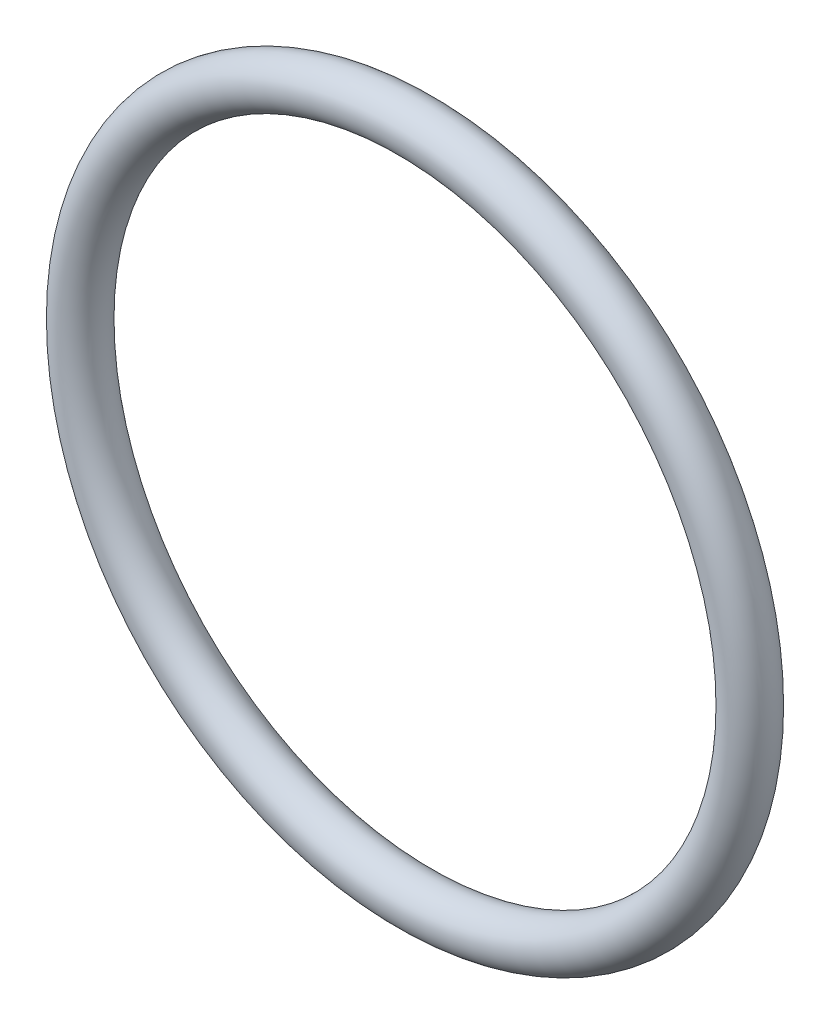
ISO-10303-21;
HEADER;
FILE_DESCRIPTION(('STEP AP214'),'2;1');
FILE_NAME('part.step','',(''),(''),'','','');
FILE_SCHEMA(('AUTOMOTIVE_DESIGN { 1 0 10303 214 1 1 1 1 }'));
ENDSEC;
DATA;
#1=APPLICATION_CONTEXT('core data for automotive mechanical design processes');
#2=APPLICATION_PROTOCOL_DEFINITION('international standard','automotive_design',2000,#1);
#3=PRODUCT_CONTEXT('',#1,'mechanical');
#4=PRODUCT('Part','Part','',(#3));
#5=PRODUCT_RELATED_PRODUCT_CATEGORY('part','',(#4));
#6=PRODUCT_DEFINITION_FORMATION('','',#4);
#7=PRODUCT_DEFINITION_CONTEXT('part definition',#1,'design');
#8=PRODUCT_DEFINITION('design','',#6,#7);
#9=PRODUCT_DEFINITION_SHAPE('','',#8);
#10=(LENGTH_UNIT() NAMED_UNIT(*) SI_UNIT(.MILLI.,.METRE.));
#11=(NAMED_UNIT(*) PLANE_ANGLE_UNIT() SI_UNIT($,.RADIAN.));
#12=(NAMED_UNIT(*) SI_UNIT($,.STERADIAN.) SOLID_ANGLE_UNIT());
#13=UNCERTAINTY_MEASURE_WITH_UNIT(LENGTH_MEASURE(1.E-05),#10,'distance_accuracy_value','');
#14=(GEOMETRIC_REPRESENTATION_CONTEXT(3) GLOBAL_UNCERTAINTY_ASSIGNED_CONTEXT((#13)) GLOBAL_UNIT_ASSIGNED_CONTEXT((#10,
#11,#12)) REPRESENTATION_CONTEXT('',''));
#15=CARTESIAN_POINT('',(0.,0.,0.));
#16=DIRECTION('',(0.,0.,1.));
#17=DIRECTION('',(1.,0.,0.));
#18=AXIS2_PLACEMENT_3D('',#15,#16,#17);
#19=CARTESIAN_POINT('',(0.,0.,0.));
#20=DIRECTION('',(0.,0.,-1.));
#21=DIRECTION('',(-1.,0.,0.));
#22=AXIS2_PLACEMENT_3D('',#19,#20,#21);
#23=TOROIDAL_SURFACE('',#22,28.,2.);
#24=CARTESIAN_POINT('',(-30.,0.,0.));
#25=VERTEX_POINT('',#24);
#26=VERTEX_LOOP('',#25);
#27=FACE_BOUND('',#26,.T.);
#28=ADVANCED_FACE('F39',(#27),#23,.T.);
#29=CLOSED_SHELL('',(#28));
#30=MANIFOLD_SOLID_BREP('B2',#29);
#31=ADVANCED_BREP_SHAPE_REPRESENTATION('',(#18,#30),#14);
#32=SHAPE_DEFINITION_REPRESENTATION(#9,#31);
ENDSEC;
END-ISO-10303-21;
